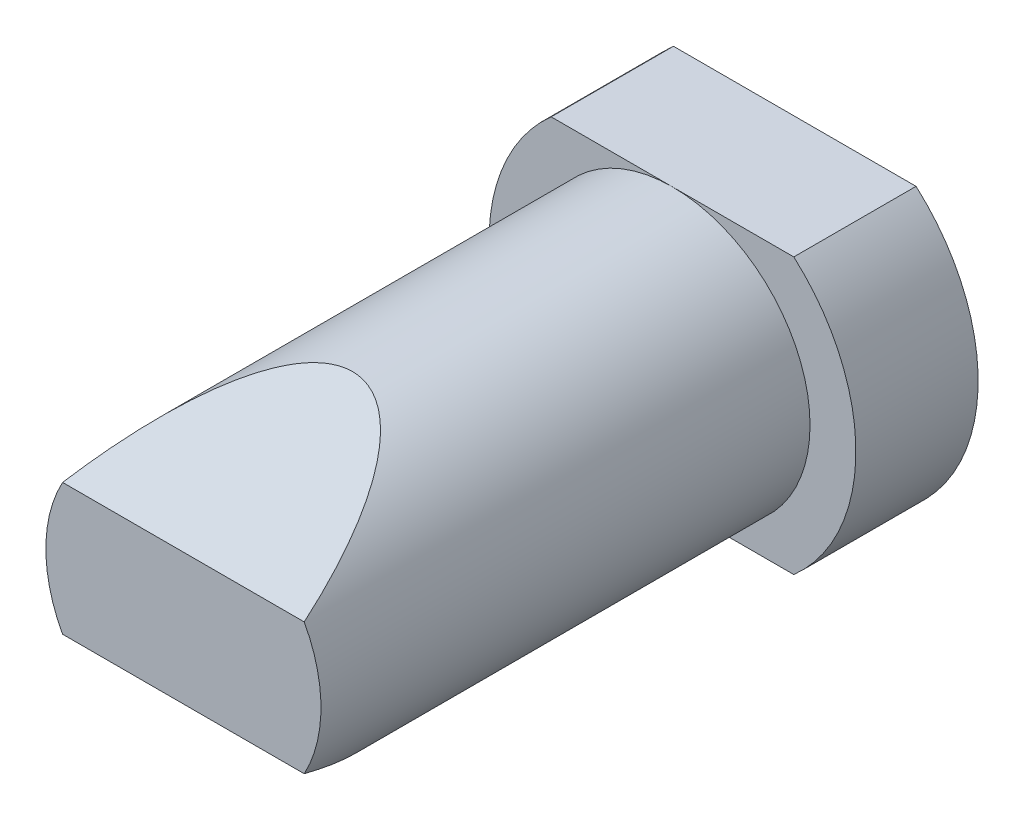
ISO-10303-21;
HEADER;
FILE_DESCRIPTION(('STEP AP214'),'2;1');
FILE_NAME('part.step','',(''),(''),'','','');
FILE_SCHEMA(('AUTOMOTIVE_DESIGN { 1 0 10303 214 1 1 1 1 }'));
ENDSEC;
DATA;
#1=APPLICATION_CONTEXT('core data for automotive mechanical design processes');
#2=APPLICATION_PROTOCOL_DEFINITION('international standard','automotive_design',2000,#1);
#3=PRODUCT_CONTEXT('',#1,'mechanical');
#4=PRODUCT('Part','Part','',(#3));
#5=PRODUCT_RELATED_PRODUCT_CATEGORY('part','',(#4));
#6=PRODUCT_DEFINITION_FORMATION('','',#4);
#7=PRODUCT_DEFINITION_CONTEXT('part definition',#1,'design');
#8=PRODUCT_DEFINITION('design','',#6,#7);
#9=PRODUCT_DEFINITION_SHAPE('','',#8);
#10=(LENGTH_UNIT() NAMED_UNIT(*) SI_UNIT(.MILLI.,.METRE.));
#11=(NAMED_UNIT(*) PLANE_ANGLE_UNIT() SI_UNIT($,.RADIAN.));
#12=(NAMED_UNIT(*) SI_UNIT($,.STERADIAN.) SOLID_ANGLE_UNIT());
#13=UNCERTAINTY_MEASURE_WITH_UNIT(LENGTH_MEASURE(1.E-05),#10,'distance_accuracy_value','');
#14=(GEOMETRIC_REPRESENTATION_CONTEXT(3) GLOBAL_UNCERTAINTY_ASSIGNED_CONTEXT((#13)) GLOBAL_UNIT_ASSIGNED_CONTEXT((#10,
#11,#12)) REPRESENTATION_CONTEXT('',''));
#15=CARTESIAN_POINT('',(0.,0.,0.));
#16=DIRECTION('',(0.,0.,1.));
#17=DIRECTION('',(1.,0.,0.));
#18=AXIS2_PLACEMENT_3D('',#15,#16,#17);
#19=CARTESIAN_POINT('',(0.,0.,-15.6666666700289));
#20=DIRECTION('',(0.,0.,-1.));
#21=DIRECTION('',(-1.,0.,0.));
#22=AXIS2_PLACEMENT_3D('',#19,#20,#21);
#23=CONICAL_SURFACE('',#22,1.60000000005311,1.04719755119509);
#24=CARTESIAN_POINT('',(0.,0.,-15.66666667));
#25=DIRECTION('',(0.,0.,1.));
#26=DIRECTION('',(1.,0.,0.));
#27=AXIS2_PLACEMENT_3D('',#24,#25,#26);
#28=CIRCLE('',#27,1.6);
#29=CARTESIAN_POINT('',(1.6,0.,-15.66666667));
#30=VERTEX_POINT('',#29);
#31=EDGE_CURVE('E100',#30,#30,#28,.F.);
#32=ORIENTED_EDGE('',*,*,#31,.T.);
#33=EDGE_LOOP('',(#32));
#34=FACE_BOUND('',#33,.T.);
#35=CARTESIAN_POINT('',(0.,-5.6843418860808E-11,-14.7429062393201));
#36=VERTEX_POINT('',#35);
#37=VERTEX_LOOP('',#36);
#38=FACE_BOUND('',#37,.T.);
#39=ADVANCED_FACE('F16',(#34,#38),#23,.F.);
#40=CARTESIAN_POINT('',(0.,0.,-16.333333335));
#41=DIRECTION('',(0.,0.,1.));
#42=DIRECTION('',(1.,0.,0.));
#43=AXIS2_PLACEMENT_3D('',#40,#41,#42);
#44=CYLINDRICAL_SURFACE('',#43,1.6);
#45=ORIENTED_EDGE('',*,*,#31,.F.);
#46=EDGE_LOOP('',(#45));
#47=FACE_BOUND('',#46,.T.);
#48=CARTESIAN_POINT('',(0.,0.,-17.));
#49=DIRECTION('',(0.,0.,1.));
#50=DIRECTION('',(1.,0.,0.));
#51=AXIS2_PLACEMENT_3D('',#48,#49,#50);
#52=CIRCLE('',#51,1.6);
#53=CARTESIAN_POINT('',(1.6,0.,-17.));
#54=VERTEX_POINT('',#53);
#55=EDGE_CURVE('E19',#54,#54,#52,.T.);
#56=ORIENTED_EDGE('',*,*,#55,.F.);
#57=EDGE_LOOP('',(#56));
#58=FACE_BOUND('',#57,.T.);
#59=ADVANCED_FACE('F135',(#47,#58),#44,.F.);
#60=CARTESIAN_POINT('',(0.,1.7975,-17.));
#61=DIRECTION('',(0.,0.,1.));
#62=DIRECTION('',(1.,0.,0.));
#63=AXIS2_PLACEMENT_3D('',#60,#61,#62);
#64=PLANE('',#63);
#65=ORIENTED_EDGE('',*,*,#55,.T.);
#66=EDGE_LOOP('',(#65));
#67=FACE_BOUND('',#66,.T.);
#68=CARTESIAN_POINT('',(0.,0.,-17.));
#69=DIRECTION('',(0.,0.,1.));
#70=DIRECTION('',(1.,0.,0.));
#71=AXIS2_PLACEMENT_3D('',#68,#69,#70);
#72=CIRCLE('',#71,1.595);
#73=CARTESIAN_POINT('',(1.595,0.,-17.));
#74=VERTEX_POINT('',#73);
#75=EDGE_CURVE('E99',#74,#74,#72,.F.);
#76=ORIENTED_EDGE('',*,*,#75,.T.);
#77=EDGE_LOOP('',(#76));
#78=FACE_BOUND('',#77,.T.);
#79=ADVANCED_FACE('F133',(#67,#78),#64,.T.);
#80=CARTESIAN_POINT('',(0.,0.,-21.7975));
#81=DIRECTION('',(0.,0.,1.));
#82=DIRECTION('',(1.,0.,0.));
#83=AXIS2_PLACEMENT_3D('',#80,#81,#82);
#84=CYLINDRICAL_SURFACE('',#83,1.595);
#85=CARTESIAN_POINT('',(0.,0.,-26.5949999999862));
#86=DIRECTION('',(0.,0.,-1.));
#87=DIRECTION('',(0.,1.,0.));
#88=AXIS2_PLACEMENT_3D('',#85,#86,#87);
#89=CIRCLE('',#88,1.59499999995205);
#90=CARTESIAN_POINT('',(0.,1.59499999995205,-26.5949999999862));
#91=VERTEX_POINT('',#90);
#92=EDGE_CURVE('E96',#91,#91,#89,.T.);
#93=ORIENTED_EDGE('',*,*,#92,.T.);
#94=EDGE_LOOP('',(#93));
#95=FACE_BOUND('',#94,.T.);
#96=ORIENTED_EDGE('',*,*,#75,.F.);
#97=EDGE_LOOP('',(#96));
#98=FACE_BOUND('',#97,.T.);
#99=ADVANCED_FACE('F143',(#95,#98),#84,.F.);
#100=CARTESIAN_POINT('',(0.,0.,-26.9999999999868));
#101=DIRECTION('',(0.,0.,-1.));
#102=DIRECTION('',(-1.,0.,0.));
#103=AXIS2_PLACEMENT_3D('',#100,#101,#102);
#104=CONICAL_SURFACE('',#103,2.00000000000955,0.785398163467625);
#105=CARTESIAN_POINT('',(0.,0.,-26.9999999999868));
#106=DIRECTION('',(0.,0.,-1.));
#107=DIRECTION('',(-1.,0.,0.));
#108=AXIS2_PLACEMENT_3D('',#105,#106,#107);
#109=CIRCLE('',#108,2.00000000000955);
#110=CARTESIAN_POINT('',(-2.00000000000955,0.,-26.9999999999868));
#111=VERTEX_POINT('',#110);
#112=EDGE_CURVE('E74',#111,#111,#109,.F.);
#113=ORIENTED_EDGE('',*,*,#112,.F.);
#114=EDGE_LOOP('',(#113));
#115=FACE_BOUND('',#114,.T.);
#116=ORIENTED_EDGE('',*,*,#92,.F.);
#117=EDGE_LOOP('',(#116));
#118=FACE_BOUND('',#117,.T.);
#119=ADVANCED_FACE('F188',(#115,#118),#104,.F.);
#120=CARTESIAN_POINT('',(0.,0.,-27.));
#121=DIRECTION('',(0.,0.,-1.));
#122=DIRECTION('',(-1.,0.,0.));
#123=AXIS2_PLACEMENT_3D('',#120,#121,#122);
#124=PLANE('',#123);
#125=DIRECTION('',(1.,0.,0.));
#126=VECTOR('',#125,1.);
#127=CARTESIAN_POINT('',(0.,4.5,-27.));
#128=LINE('',#127,#126);
#129=CARTESIAN_POINT('',(3.96862696659689,4.5,-27.));
#130=VERTEX_POINT('',#129);
#131=CARTESIAN_POINT('',(-3.96862696659689,4.5,-27.));
#132=VERTEX_POINT('',#131);
#133=EDGE_CURVE('E68',#130,#132,#128,.F.);
#134=ORIENTED_EDGE('',*,*,#133,.F.);
#135=CARTESIAN_POINT('',(0.,0.,-27.));
#136=DIRECTION('',(0.,0.,-1.));
#137=DIRECTION('',(-1.,0.,0.));
#138=AXIS2_PLACEMENT_3D('',#135,#136,#137);
#139=CIRCLE('',#138,6.);
#140=CARTESIAN_POINT('',(3.96862696659689,-4.5,-27.));
#141=VERTEX_POINT('',#140);
#142=EDGE_CURVE('E89',#141,#130,#139,.F.);
#143=ORIENTED_EDGE('',*,*,#142,.F.);
#144=DIRECTION('',(1.,0.,0.));
#145=VECTOR('',#144,1.);
#146=CARTESIAN_POINT('',(0.,-4.5,-27.));
#147=LINE('',#146,#145);
#148=CARTESIAN_POINT('',(-3.96862696659689,-4.5,-27.));
#149=VERTEX_POINT('',#148);
#150=EDGE_CURVE('E70',#149,#141,#147,.T.);
#151=ORIENTED_EDGE('',*,*,#150,.F.);
#152=CARTESIAN_POINT('',(0.,0.,-27.));
#153=DIRECTION('',(0.,0.,-1.));
#154=DIRECTION('',(-1.,0.,0.));
#155=AXIS2_PLACEMENT_3D('',#152,#153,#154);
#156=CIRCLE('',#155,6.);
#157=EDGE_CURVE('E62',#132,#149,#156,.F.);
#158=ORIENTED_EDGE('',*,*,#157,.F.);
#159=EDGE_LOOP('',(#134,#143,#151,#158));
#160=FACE_BOUND('',#159,.T.);
#161=ORIENTED_EDGE('',*,*,#112,.T.);
#162=EDGE_LOOP('',(#161));
#163=FACE_BOUND('',#162,.T.);
#164=ADVANCED_FACE('F64',(#160,#163),#124,.T.);
#165=CARTESIAN_POINT('',(0.,0.,-25.));
#166=DIRECTION('',(0.,0.,-1.));
#167=DIRECTION('',(-1.,0.,0.));
#168=AXIS2_PLACEMENT_3D('',#165,#166,#167);
#169=CYLINDRICAL_SURFACE('',#168,6.);
#170=DIRECTION('',(0.,0.,1.));
#171=VECTOR('',#170,1.);
#172=CARTESIAN_POINT('',(-3.96862696659689,4.5,-25.));
#173=LINE('',#172,#171);
#174=CARTESIAN_POINT('',(-3.96862696659689,4.5,-23.));
#175=VERTEX_POINT('',#174);
#176=EDGE_CURVE('E77',#132,#175,#173,.T.);
#177=ORIENTED_EDGE('',*,*,#176,.F.);
#178=ORIENTED_EDGE('',*,*,#157,.T.);
#179=DIRECTION('',(0.,0.,-1.));
#180=VECTOR('',#179,1.);
#181=CARTESIAN_POINT('',(-3.96862696659689,-4.5,-25.));
#182=LINE('',#181,#180);
#183=CARTESIAN_POINT('',(-3.96862696659689,-4.5,-23.));
#184=VERTEX_POINT('',#183);
#185=EDGE_CURVE('E94',#184,#149,#182,.T.);
#186=ORIENTED_EDGE('',*,*,#185,.F.);
#187=CARTESIAN_POINT('',(0.,0.,-23.));
#188=DIRECTION('',(0.,0.,-1.));
#189=DIRECTION('',(-1.,0.,0.));
#190=AXIS2_PLACEMENT_3D('',#187,#188,#189);
#191=CIRCLE('',#190,6.);
#192=EDGE_CURVE('E73',#175,#184,#191,.F.);
#193=ORIENTED_EDGE('',*,*,#192,.F.);
#194=EDGE_LOOP('',(#177,#178,#186,#193));
#195=FACE_BOUND('',#194,.T.);
#196=ADVANCED_FACE('F78',(#195),#169,.T.);
#197=CARTESIAN_POINT('',(0.,0.,-23.));
#198=DIRECTION('',(0.,0.,1.));
#199=DIRECTION('',(1.,0.,0.));
#200=AXIS2_PLACEMENT_3D('',#197,#198,#199);
#201=PLANE('',#200);
#202=DIRECTION('',(1.,0.,0.));
#203=VECTOR('',#202,1.);
#204=CARTESIAN_POINT('',(0.,4.5,-23.));
#205=LINE('',#204,#203);
#206=CARTESIAN_POINT('',(0.,4.5,-23.));
#207=VERTEX_POINT('',#206);
#208=EDGE_CURVE('E82',#175,#207,#205,.T.);
#209=ORIENTED_EDGE('',*,*,#208,.F.);
#210=ORIENTED_EDGE('',*,*,#192,.T.);
#211=DIRECTION('',(1.,0.,0.));
#212=VECTOR('',#211,1.);
#213=CARTESIAN_POINT('',(0.,-4.5,-23.));
#214=LINE('',#213,#212);
#215=CARTESIAN_POINT('',(0.,-4.5,-23.));
#216=VERTEX_POINT('',#215);
#217=EDGE_CURVE('E34',#216,#184,#214,.F.);
#218=ORIENTED_EDGE('',*,*,#217,.F.);
#219=CARTESIAN_POINT('',(0.,0.,-23.));
#220=DIRECTION('',(0.,0.,-1.));
#221=DIRECTION('',(-1.,0.,0.));
#222=AXIS2_PLACEMENT_3D('',#219,#220,#221);
#223=CIRCLE('',#222,4.5);
#224=EDGE_CURVE('E119',#207,#216,#223,.F.);
#225=ORIENTED_EDGE('',*,*,#224,.F.);
#226=EDGE_LOOP('',(#209,#210,#218,#225));
#227=FACE_BOUND('',#226,.T.);
#228=ADVANCED_FACE('F180',(#227),#201,.T.);
#229=CARTESIAN_POINT('',(0.,-4.5,-25.));
#230=DIRECTION('',(0.,-1.,0.));
#231=DIRECTION('',(0.,0.,-1.));
#232=AXIS2_PLACEMENT_3D('',#229,#230,#231);
#233=PLANE('',#232);
#234=DIRECTION('',(1.,0.,0.));
#235=VECTOR('',#234,1.);
#236=CARTESIAN_POINT('',(0.,-4.5,-23.));
#237=LINE('',#236,#235);
#238=CARTESIAN_POINT('',(3.96862696659689,-4.5,-23.));
#239=VERTEX_POINT('',#238);
#240=EDGE_CURVE('E115',#216,#239,#237,.T.);
#241=ORIENTED_EDGE('',*,*,#240,.F.);
#242=ORIENTED_EDGE('',*,*,#217,.T.);
#243=ORIENTED_EDGE('',*,*,#185,.T.);
#244=ORIENTED_EDGE('',*,*,#150,.T.);
#245=DIRECTION('',(0.,0.,-1.));
#246=VECTOR('',#245,1.);
#247=CARTESIAN_POINT('',(3.96862696659689,-4.5,-25.));
#248=LINE('',#247,#246);
#249=EDGE_CURVE('E124',#239,#141,#248,.T.);
#250=ORIENTED_EDGE('',*,*,#249,.F.);
#251=EDGE_LOOP('',(#241,#242,#243,#244,#250));
#252=FACE_BOUND('',#251,.T.);
#253=ADVANCED_FACE('F176',(#252),#233,.T.);
#254=CARTESIAN_POINT('',(0.,0.,-25.));
#255=DIRECTION('',(0.,0.,-1.));
#256=DIRECTION('',(-1.,0.,0.));
#257=AXIS2_PLACEMENT_3D('',#254,#255,#256);
#258=CYLINDRICAL_SURFACE('',#257,6.);
#259=DIRECTION('',(0.,0.,1.));
#260=VECTOR('',#259,1.);
#261=CARTESIAN_POINT('',(3.96862696659689,4.5,-25.));
#262=LINE('',#261,#260);
#263=CARTESIAN_POINT('',(3.96862696659689,4.5,-23.));
#264=VERTEX_POINT('',#263);
#265=EDGE_CURVE('E87',#264,#130,#262,.F.);
#266=ORIENTED_EDGE('',*,*,#265,.F.);
#267=CARTESIAN_POINT('',(0.,0.,-23.));
#268=DIRECTION('',(0.,0.,-1.));
#269=DIRECTION('',(-1.,0.,0.));
#270=AXIS2_PLACEMENT_3D('',#267,#268,#269);
#271=CIRCLE('',#270,6.);
#272=EDGE_CURVE('E112',#239,#264,#271,.F.);
#273=ORIENTED_EDGE('',*,*,#272,.F.);
#274=ORIENTED_EDGE('',*,*,#249,.T.);
#275=ORIENTED_EDGE('',*,*,#142,.T.);
#276=EDGE_LOOP('',(#266,#273,#274,#275));
#277=FACE_BOUND('',#276,.T.);
#278=ADVANCED_FACE('F173',(#277),#258,.T.);
#279=CARTESIAN_POINT('',(0.,4.5,-25.));
#280=DIRECTION('',(0.,1.,0.));
#281=DIRECTION('',(0.,0.,1.));
#282=AXIS2_PLACEMENT_3D('',#279,#280,#281);
#283=PLANE('',#282);
#284=ORIENTED_EDGE('',*,*,#208,.T.);
#285=DIRECTION('',(1.,0.,0.));
#286=VECTOR('',#285,1.);
#287=CARTESIAN_POINT('',(0.,4.5,-23.));
#288=LINE('',#287,#286);
#289=EDGE_CURVE('E111',#264,#207,#288,.F.);
#290=ORIENTED_EDGE('',*,*,#289,.F.);
#291=ORIENTED_EDGE('',*,*,#265,.T.);
#292=ORIENTED_EDGE('',*,*,#133,.T.);
#293=ORIENTED_EDGE('',*,*,#176,.T.);
#294=EDGE_LOOP('',(#284,#290,#291,#292,#293));
#295=FACE_BOUND('',#294,.T.);
#296=ADVANCED_FACE('F84',(#295),#283,.T.);
#297=CARTESIAN_POINT('',(0.,3.,-9.));
#298=DIRECTION('',(0.,0.920504853452441,0.390731128489273));
#299=DIRECTION('',(0.,-0.390731128489273,0.920504853452441));
#300=AXIS2_PLACEMENT_3D('',#297,#298,#299);
#301=PLANE('',#300);
#302=DIRECTION('',(1.,0.,0.));
#303=VECTOR('',#302,1.);
#304=CARTESIAN_POINT('',(0.,2.15105036758079,-7.));
#305=LINE('',#304,#303);
#306=CARTESIAN_POINT('',(3.95259184790569,2.15105036758079,-7.));
#307=VERTEX_POINT('',#306);
#308=CARTESIAN_POINT('',(-3.95259184790569,2.15105036758079,-7.));
#309=VERTEX_POINT('',#308);
#310=EDGE_CURVE('E341',#307,#309,#305,.F.);
#311=ORIENTED_EDGE('',*,*,#310,.F.);
#312=CARTESIAN_POINT('',(0.,0.,-1.93244290252873));
#313=DIRECTION('',(0.,0.920504853452441,0.390731128489273));
#314=DIRECTION('',(0.,0.390731128489273,-0.920504853452441));
#315=AXIS2_PLACEMENT_3D('',#312,#313,#314);
#316=ELLIPSE('',#315,11.5168709936136,4.5);
#317=EDGE_CURVE('E108',#309,#307,#316,.F.);
#318=ORIENTED_EDGE('',*,*,#317,.F.);
#319=EDGE_LOOP('',(#311,#318));
#320=FACE_BOUND('',#319,.T.);
#321=ADVANCED_FACE('F166',(#320),#301,.T.);
#322=CARTESIAN_POINT('',(0.,0.,-7.));
#323=DIRECTION('',(0.,0.,1.));
#324=DIRECTION('',(1.,0.,0.));
#325=AXIS2_PLACEMENT_3D('',#322,#323,#324);
#326=PLANE('',#325);
#327=ORIENTED_EDGE('',*,*,#310,.T.);
#328=CARTESIAN_POINT('',(0.,0.,-7.));
#329=DIRECTION('',(0.,0.,-1.));
#330=DIRECTION('',(-1.,0.,0.));
#331=AXIS2_PLACEMENT_3D('',#328,#329,#330);
#332=CIRCLE('',#331,4.5);
#333=CARTESIAN_POINT('',(-3.95259184790569,-2.15105036758079,-7.));
#334=VERTEX_POINT('',#333);
#335=EDGE_CURVE('E116',#334,#309,#332,.T.);
#336=ORIENTED_EDGE('',*,*,#335,.F.);
#337=DIRECTION('',(1.,0.,0.));
#338=VECTOR('',#337,1.);
#339=CARTESIAN_POINT('',(0.,-2.15105036758079,-7.));
#340=LINE('',#339,#338);
#341=CARTESIAN_POINT('',(3.95259184790569,-2.15105036758079,-7.));
#342=VERTEX_POINT('',#341);
#343=EDGE_CURVE('E122',#342,#334,#340,.F.);
#344=ORIENTED_EDGE('',*,*,#343,.F.);
#345=CARTESIAN_POINT('',(0.,0.,-7.));
#346=DIRECTION('',(0.,0.,-1.));
#347=DIRECTION('',(-1.,0.,0.));
#348=AXIS2_PLACEMENT_3D('',#345,#346,#347);
#349=CIRCLE('',#348,4.5);
#350=EDGE_CURVE('E105',#307,#342,#349,.T.);
#351=ORIENTED_EDGE('',*,*,#350,.F.);
#352=EDGE_LOOP('',(#327,#336,#344,#351));
#353=FACE_BOUND('',#352,.T.);
#354=ADVANCED_FACE('F162',(#353),#326,.T.);
#355=CARTESIAN_POINT('',(0.,-3.,-9.));
#356=DIRECTION('',(0.,-0.920504853452441,0.390731128489273));
#357=DIRECTION('',(0.,-0.390731128489273,-0.920504853452441));
#358=AXIS2_PLACEMENT_3D('',#355,#356,#357);
#359=PLANE('',#358);
#360=ORIENTED_EDGE('',*,*,#343,.T.);
#361=CARTESIAN_POINT('',(0.,0.,-1.93244290252872));
#362=DIRECTION('',(0.,-0.920504853452441,0.390731128489273));
#363=DIRECTION('',(0.,-0.390731128489273,-0.920504853452441));
#364=AXIS2_PLACEMENT_3D('',#361,#362,#363);
#365=ELLIPSE('',#364,11.5168709936136,4.5);
#366=EDGE_CURVE('E25',#342,#334,#365,.F.);
#367=ORIENTED_EDGE('',*,*,#366,.F.);
#368=EDGE_LOOP('',(#360,#367));
#369=FACE_BOUND('',#368,.T.);
#370=ADVANCED_FACE('F155',(#369),#359,.T.);
#371=CARTESIAN_POINT('',(0.,0.,-23.));
#372=DIRECTION('',(0.,0.,1.));
#373=DIRECTION('',(1.,0.,0.));
#374=AXIS2_PLACEMENT_3D('',#371,#372,#373);
#375=PLANE('',#374);
#376=ORIENTED_EDGE('',*,*,#289,.T.);
#377=CARTESIAN_POINT('',(0.,0.,-23.));
#378=DIRECTION('',(0.,0.,-1.));
#379=DIRECTION('',(-1.,0.,0.));
#380=AXIS2_PLACEMENT_3D('',#377,#378,#379);
#381=CIRCLE('',#380,4.5);
#382=EDGE_CURVE('E11',#216,#207,#381,.F.);
#383=ORIENTED_EDGE('',*,*,#382,.F.);
#384=ORIENTED_EDGE('',*,*,#240,.T.);
#385=ORIENTED_EDGE('',*,*,#272,.T.);
#386=EDGE_LOOP('',(#376,#383,#384,#385));
#387=FACE_BOUND('',#386,.T.);
#388=ADVANCED_FACE('F149',(#387),#375,.T.);
#389=CARTESIAN_POINT('',(0.,0.,-15.));
#390=DIRECTION('',(0.,0.,-1.));
#391=DIRECTION('',(-1.,0.,0.));
#392=AXIS2_PLACEMENT_3D('',#389,#390,#391);
#393=CYLINDRICAL_SURFACE('',#392,4.5);
#394=ORIENTED_EDGE('',*,*,#335,.T.);
#395=ORIENTED_EDGE('',*,*,#317,.T.);
#396=ORIENTED_EDGE('',*,*,#350,.T.);
#397=ORIENTED_EDGE('',*,*,#366,.T.);
#398=EDGE_LOOP('',(#394,#395,#396,#397));
#399=FACE_BOUND('',#398,.T.);
#400=ORIENTED_EDGE('',*,*,#382,.T.);
#401=ORIENTED_EDGE('',*,*,#224,.T.);
#402=EDGE_LOOP('',(#400,#401));
#403=FACE_BOUND('',#402,.T.);
#404=ADVANCED_FACE('F147',(#399,#403),#393,.T.);
#405=CLOSED_SHELL('',(#39,#59,#79,#99,#119,#164,#196,#228,#253,#278,#296,#321,#354,#370,#388,#404));
#406=MANIFOLD_SOLID_BREP('B1',#405);
#407=ADVANCED_BREP_SHAPE_REPRESENTATION('',(#18,#406),#14);
#408=SHAPE_DEFINITION_REPRESENTATION(#9,#407);
ENDSEC;
END-ISO-10303-21;
